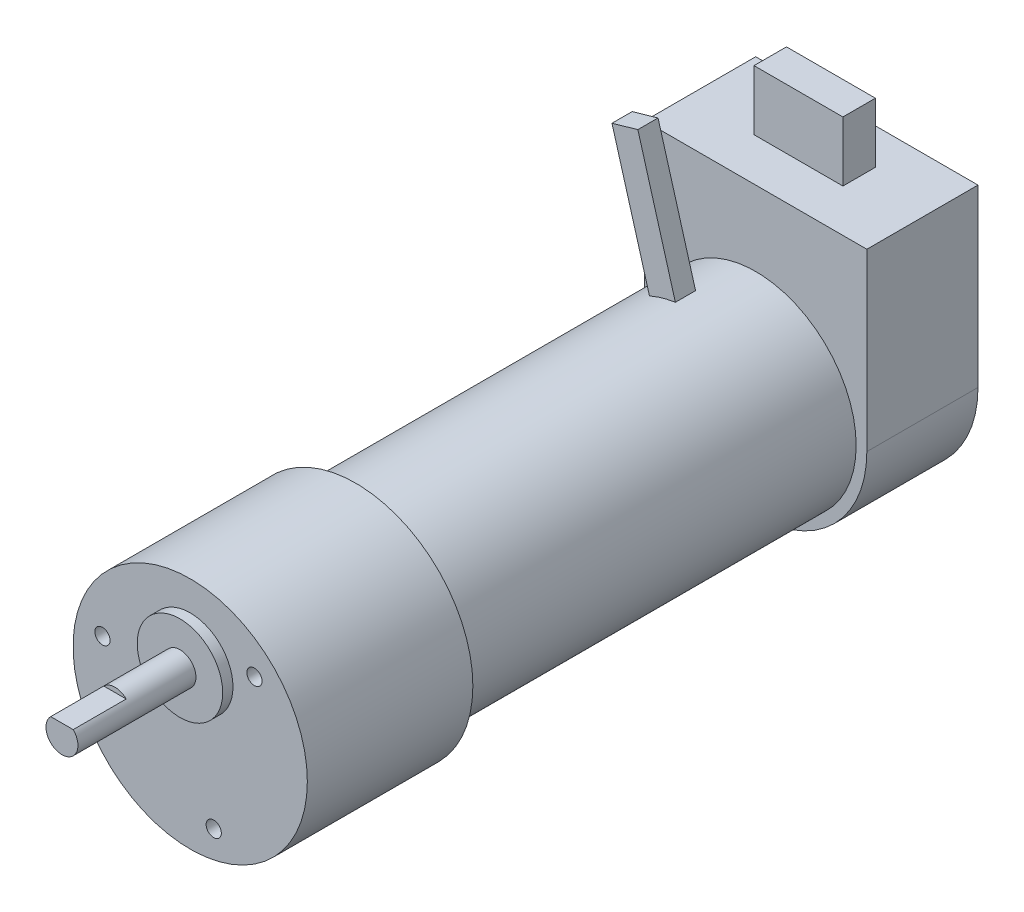
ISO-10303-21;
HEADER;
FILE_DESCRIPTION(('STEP AP214'),'2;1');
FILE_NAME('part.step','',(''),(''),'','','');
FILE_SCHEMA(('AUTOMOTIVE_DESIGN { 1 0 10303 214 1 1 1 1 }'));
ENDSEC;
DATA;
#1=APPLICATION_CONTEXT('core data for automotive mechanical design processes');
#2=APPLICATION_PROTOCOL_DEFINITION('international standard','automotive_design',2000,#1);
#3=PRODUCT_CONTEXT('',#1,'mechanical');
#4=PRODUCT('Part','Part','',(#3));
#5=PRODUCT_RELATED_PRODUCT_CATEGORY('part','',(#4));
#6=PRODUCT_DEFINITION_FORMATION('','',#4);
#7=PRODUCT_DEFINITION_CONTEXT('part definition',#1,'design');
#8=PRODUCT_DEFINITION('design','',#6,#7);
#9=PRODUCT_DEFINITION_SHAPE('','',#8);
#10=(LENGTH_UNIT() NAMED_UNIT(*) SI_UNIT(.MILLI.,.METRE.));
#11=(NAMED_UNIT(*) PLANE_ANGLE_UNIT() SI_UNIT($,.RADIAN.));
#12=(NAMED_UNIT(*) SI_UNIT($,.STERADIAN.) SOLID_ANGLE_UNIT());
#13=UNCERTAINTY_MEASURE_WITH_UNIT(LENGTH_MEASURE(1.E-05),#10,'distance_accuracy_value','');
#14=(GEOMETRIC_REPRESENTATION_CONTEXT(3) GLOBAL_UNCERTAINTY_ASSIGNED_CONTEXT((#13)) GLOBAL_UNIT_ASSIGNED_CONTEXT((#10,
#11,#12)) REPRESENTATION_CONTEXT('',''));
#15=CARTESIAN_POINT('',(0.,0.,0.));
#16=DIRECTION('',(0.,0.,1.));
#17=DIRECTION('',(1.,0.,0.));
#18=AXIS2_PLACEMENT_3D('',#15,#16,#17);
#19=CARTESIAN_POINT('',(0.,0.,0.));
#20=DIRECTION('',(0.,0.,-1.));
#21=DIRECTION('',(-1.,0.,0.));
#22=AXIS2_PLACEMENT_3D('',#19,#20,#21);
#23=PLANE('',#22);
#24=CARTESIAN_POINT('',(9.54152212863612,9.54152212863582,0.));
#25=DIRECTION('',(0.,0.,1.));
#26=DIRECTION('',(1.,0.,0.));
#27=AXIS2_PLACEMENT_3D('',#24,#25,#26);
#28=CIRCLE('',#27,1.1303);
#29=CARTESIAN_POINT('',(10.6718221286361,9.54152212863582,0.));
#30=VERTEX_POINT('',#29);
#31=EDGE_CURVE('E207',#30,#30,#28,.T.);
#32=ORIENTED_EDGE('',*,*,#31,.F.);
#33=EDGE_LOOP('',(#32));
#34=FACE_BOUND('',#33,.T.);
#35=CARTESIAN_POINT('',(-13.0339616184881,3.49243948985228,0.));
#36=DIRECTION('',(0.,0.,1.));
#37=DIRECTION('',(1.,0.,0.));
#38=AXIS2_PLACEMENT_3D('',#35,#36,#37);
#39=CIRCLE('',#38,1.1303);
#40=CARTESIAN_POINT('',(-11.9036616184881,3.49243948985228,0.));
#41=VERTEX_POINT('',#40);
#42=EDGE_CURVE('E216',#41,#41,#39,.T.);
#43=ORIENTED_EDGE('',*,*,#42,.F.);
#44=EDGE_LOOP('',(#43));
#45=FACE_BOUND('',#44,.T.);
#46=CARTESIAN_POINT('',(3.49243948985205,-13.0339616184881,0.));
#47=DIRECTION('',(0.,0.,1.));
#48=DIRECTION('',(1.,0.,0.));
#49=AXIS2_PLACEMENT_3D('',#46,#47,#48);
#50=CIRCLE('',#49,1.1303);
#51=CARTESIAN_POINT('',(4.62273948985205,-13.0339616184881,0.));
#52=VERTEX_POINT('',#51);
#53=EDGE_CURVE('E224',#52,#52,#50,.T.);
#54=ORIENTED_EDGE('',*,*,#53,.F.);
#55=EDGE_LOOP('',(#54));
#56=FACE_BOUND('',#55,.T.);
#57=CARTESIAN_POINT('',(0.,0.,0.));
#58=DIRECTION('',(0.,0.,1.));
#59=DIRECTION('',(1.,0.,0.));
#60=AXIS2_PLACEMENT_3D('',#57,#58,#59);
#61=CIRCLE('',#60,17.399);
#62=CARTESIAN_POINT('',(17.399,0.,0.));
#63=VERTEX_POINT('',#62);
#64=EDGE_CURVE('E340',#63,#63,#61,.T.);
#65=ORIENTED_EDGE('',*,*,#64,.T.);
#66=EDGE_LOOP('',(#65));
#67=FACE_BOUND('',#66,.T.);
#68=CARTESIAN_POINT('',(0.,6.6548,0.));
#69=DIRECTION('',(0.,0.,-1.));
#70=DIRECTION('',(-1.,0.,0.));
#71=AXIS2_PLACEMENT_3D('',#68,#69,#70);
#72=CIRCLE('',#71,6.35);
#73=CARTESIAN_POINT('',(-6.35,6.6548,0.));
#74=VERTEX_POINT('',#73);
#75=EDGE_CURVE('E344',#74,#74,#72,.F.);
#76=ORIENTED_EDGE('',*,*,#75,.F.);
#77=EDGE_LOOP('',(#76));
#78=FACE_BOUND('',#77,.T.);
#79=ADVANCED_FACE('F47',(#34,#45,#56,#67,#78),#23,.F.);
#80=CARTESIAN_POINT('',(16.51,26.035,-100.5078));
#81=DIRECTION('',(0.,-1.,0.));
#82=DIRECTION('',(0.,0.,-1.));
#83=AXIS2_PLACEMENT_3D('',#80,#81,#82);
#84=PLANE('',#83);
#85=DIRECTION('',(1.,0.,0.));
#86=VECTOR('',#85,1.);
#87=CARTESIAN_POINT('',(16.51,26.035,-83.9978));
#88=LINE('',#87,#86);
#89=CARTESIAN_POINT('',(-16.51,26.035,-83.9978));
#90=VERTEX_POINT('',#89);
#91=CARTESIAN_POINT('',(16.51,26.035,-83.9978));
#92=VERTEX_POINT('',#91);
#93=EDGE_CURVE('E311',#90,#92,#88,.T.);
#94=ORIENTED_EDGE('',*,*,#93,.T.);
#95=DIRECTION('',(0.,0.,1.));
#96=VECTOR('',#95,1.);
#97=CARTESIAN_POINT('',(16.51,26.035,-100.5078));
#98=LINE('',#97,#96);
#99=CARTESIAN_POINT('',(16.51,26.035,-100.5078));
#100=VERTEX_POINT('',#99);
#101=EDGE_CURVE('E317',#100,#92,#98,.T.);
#102=ORIENTED_EDGE('',*,*,#101,.F.);
#103=DIRECTION('',(1.,0.,0.));
#104=VECTOR('',#103,1.);
#105=CARTESIAN_POINT('',(16.51,26.035,-100.5078));
#106=LINE('',#105,#104);
#107=CARTESIAN_POINT('',(-16.51,26.035,-100.5078));
#108=VERTEX_POINT('',#107);
#109=EDGE_CURVE('E299',#108,#100,#106,.T.);
#110=ORIENTED_EDGE('',*,*,#109,.F.);
#111=DIRECTION('',(0.,0.,1.));
#112=VECTOR('',#111,1.);
#113=CARTESIAN_POINT('',(-16.51,26.035,-100.5078));
#114=LINE('',#113,#112);
#115=EDGE_CURVE('E320',#108,#90,#114,.T.);
#116=ORIENTED_EDGE('',*,*,#115,.T.);
#117=EDGE_LOOP('',(#94,#102,#110,#116));
#118=FACE_BOUND('',#117,.T.);
#119=DIRECTION('',(0.,0.,-1.));
#120=VECTOR('',#119,1.);
#121=CARTESIAN_POINT('',(6.604,26.035,-90.3478));
#122=LINE('',#121,#120);
#123=CARTESIAN_POINT('',(6.604,26.035,-90.3478));
#124=VERTEX_POINT('',#123);
#125=CARTESIAN_POINT('',(6.604,26.035,-95.1738));
#126=VERTEX_POINT('',#125);
#127=EDGE_CURVE('E264',#124,#126,#122,.T.);
#128=ORIENTED_EDGE('',*,*,#127,.F.);
#129=DIRECTION('',(-1.,0.,0.));
#130=VECTOR('',#129,1.);
#131=CARTESIAN_POINT('',(6.604,26.035,-90.3478));
#132=LINE('',#131,#130);
#133=CARTESIAN_POINT('',(-6.604,26.035,-90.3478));
#134=VERTEX_POINT('',#133);
#135=EDGE_CURVE('E288',#124,#134,#132,.T.);
#136=ORIENTED_EDGE('',*,*,#135,.T.);
#137=DIRECTION('',(0.,0.,-1.));
#138=VECTOR('',#137,1.);
#139=CARTESIAN_POINT('',(-6.604,26.035,-90.3478));
#140=LINE('',#139,#138);
#141=CARTESIAN_POINT('',(-6.604,26.035,-95.1738));
#142=VERTEX_POINT('',#141);
#143=EDGE_CURVE('E274',#134,#142,#140,.T.);
#144=ORIENTED_EDGE('',*,*,#143,.T.);
#145=DIRECTION('',(-1.,0.,0.));
#146=VECTOR('',#145,1.);
#147=CARTESIAN_POINT('',(6.604,26.035,-95.1738));
#148=LINE('',#147,#146);
#149=EDGE_CURVE('E285',#126,#142,#148,.T.);
#150=ORIENTED_EDGE('',*,*,#149,.F.);
#151=EDGE_LOOP('',(#128,#136,#144,#150));
#152=FACE_BOUND('',#151,.T.);
#153=ADVANCED_FACE('F375',(#118,#152),#84,.F.);
#154=CARTESIAN_POINT('',(0.,0.,55.));
#155=DIRECTION('',(0.,0.,1.));
#156=DIRECTION('',(1.,0.,0.));
#157=AXIS2_PLACEMENT_3D('',#154,#155,#156);
#158=CYLINDRICAL_SURFACE('',#157,17.399);
#159=ORIENTED_EDGE('',*,*,#64,.F.);
#160=EDGE_LOOP('',(#159));
#161=FACE_BOUND('',#160,.T.);
#162=CARTESIAN_POINT('',(0.,0.,-24.5872));
#163=DIRECTION('',(0.,0.,1.));
#164=DIRECTION('',(1.,0.,0.));
#165=AXIS2_PLACEMENT_3D('',#162,#163,#164);
#166=CIRCLE('',#165,17.399);
#167=CARTESIAN_POINT('',(17.399,0.,-24.5872));
#168=VERTEX_POINT('',#167);
#169=EDGE_CURVE('E336',#168,#168,#166,.T.);
#170=ORIENTED_EDGE('',*,*,#169,.T.);
#171=EDGE_LOOP('',(#170));
#172=FACE_BOUND('',#171,.T.);
#173=ADVANCED_FACE('F381',(#161,#172),#158,.T.);
#174=CARTESIAN_POINT('',(0.,17.399,-24.5872));
#175=DIRECTION('',(0.,0.,1.));
#176=DIRECTION('',(1.,0.,0.));
#177=AXIS2_PLACEMENT_3D('',#174,#175,#176);
#178=PLANE('',#177);
#179=ORIENTED_EDGE('',*,*,#169,.F.);
#180=EDGE_LOOP('',(#179));
#181=FACE_BOUND('',#180,.T.);
#182=CARTESIAN_POINT('',(0.,0.,-24.5872));
#183=DIRECTION('',(0.,0.,1.));
#184=DIRECTION('',(1.,0.,0.));
#185=AXIS2_PLACEMENT_3D('',#182,#183,#184);
#186=CIRCLE('',#185,14.9225);
#187=CARTESIAN_POINT('',(14.9225,0.,-24.5872));
#188=VERTEX_POINT('',#187);
#189=EDGE_CURVE('E332',#188,#188,#186,.T.);
#190=ORIENTED_EDGE('',*,*,#189,.T.);
#191=EDGE_LOOP('',(#190));
#192=FACE_BOUND('',#191,.T.);
#193=ADVANCED_FACE('F449',(#181,#192),#178,.F.);
#194=CARTESIAN_POINT('',(0.,0.,55.));
#195=DIRECTION('',(0.,0.,1.));
#196=DIRECTION('',(1.,0.,0.));
#197=AXIS2_PLACEMENT_3D('',#194,#195,#196);
#198=CYLINDRICAL_SURFACE('',#197,14.9225);
#199=DIRECTION('',(0.,0.,1.));
#200=VECTOR('',#199,1.);
#201=CARTESIAN_POINT('',(-2.15356512740972,14.7662846881673,55.));
#202=LINE('',#201,#200);
#203=CARTESIAN_POINT('',(-2.15356512740972,14.7662846881673,-77.2178));
#204=VERTEX_POINT('',#203);
#205=CARTESIAN_POINT('',(-2.15356512740972,14.7662846881673,-74.2178));
#206=VERTEX_POINT('',#205);
#207=EDGE_CURVE('E55',#204,#206,#202,.T.);
#208=ORIENTED_EDGE('',*,*,#207,.T.);
#209=CARTESIAN_POINT('',(0.,0.,-74.2178));
#210=DIRECTION('',(0.,0.,1.));
#211=DIRECTION('',(1.,0.,0.));
#212=AXIS2_PLACEMENT_3D('',#209,#210,#211);
#213=CIRCLE('',#212,14.9225);
#214=CARTESIAN_POINT('',(-5.998611911163,13.6637352648993,-74.2178));
#215=VERTEX_POINT('',#214);
#216=EDGE_CURVE('E11',#206,#215,#213,.T.);
#217=ORIENTED_EDGE('',*,*,#216,.T.);
#218=DIRECTION('',(0.,0.,1.));
#219=VECTOR('',#218,1.);
#220=CARTESIAN_POINT('',(-5.998611911163,13.6637352648993,55.));
#221=LINE('',#220,#219);
#222=CARTESIAN_POINT('',(-5.998611911163,13.6637352648993,-77.2178));
#223=VERTEX_POINT('',#222);
#224=EDGE_CURVE('E174',#215,#223,#221,.F.);
#225=ORIENTED_EDGE('',*,*,#224,.T.);
#226=CARTESIAN_POINT('',(0.,0.,-77.2178));
#227=DIRECTION('',(0.,0.,1.));
#228=DIRECTION('',(1.,0.,0.));
#229=AXIS2_PLACEMENT_3D('',#226,#227,#228);
#230=CIRCLE('',#229,14.9225);
#231=EDGE_CURVE('E348',#204,#223,#230,.T.);
#232=ORIENTED_EDGE('',*,*,#231,.F.);
#233=EDGE_LOOP('',(#208,#217,#225,#232));
#234=FACE_BOUND('',#233,.T.);
#235=ORIENTED_EDGE('',*,*,#189,.F.);
#236=EDGE_LOOP('',(#235));
#237=FACE_BOUND('',#236,.T.);
#238=CARTESIAN_POINT('',(0.,0.,-83.9978));
#239=DIRECTION('',(0.,0.,-1.));
#240=DIRECTION('',(-1.,0.,0.));
#241=AXIS2_PLACEMENT_3D('',#238,#239,#240);
#242=CIRCLE('',#241,14.9225);
#243=CARTESIAN_POINT('',(-14.9225,0.,-83.9978));
#244=VERTEX_POINT('',#243);
#245=EDGE_CURVE('E328',#244,#244,#242,.T.);
#246=ORIENTED_EDGE('',*,*,#245,.F.);
#247=EDGE_LOOP('',(#246));
#248=FACE_BOUND('',#247,.T.);
#249=ADVANCED_FACE('F354',(#234,#237,#248),#198,.T.);
#250=CARTESIAN_POINT('',(0.,0.,-83.9978));
#251=DIRECTION('',(0.,0.,-1.));
#252=DIRECTION('',(-1.,0.,0.));
#253=AXIS2_PLACEMENT_3D('',#250,#251,#252);
#254=PLANE('',#253);
#255=CARTESIAN_POINT('',(0.,0.,-83.9978));
#256=DIRECTION('',(0.,0.,-1.));
#257=DIRECTION('',(-1.,0.,0.));
#258=AXIS2_PLACEMENT_3D('',#255,#256,#257);
#259=CIRCLE('',#258,16.51);
#260=CARTESIAN_POINT('',(16.51,0.,-83.9978));
#261=VERTEX_POINT('',#260);
#262=CARTESIAN_POINT('',(-16.51,0.,-83.9978));
#263=VERTEX_POINT('',#262);
#264=EDGE_CURVE('E291',#261,#263,#259,.T.);
#265=ORIENTED_EDGE('',*,*,#264,.F.);
#266=DIRECTION('',(0.,-1.,0.));
#267=VECTOR('',#266,1.);
#268=CARTESIAN_POINT('',(16.51,0.,-83.9978));
#269=LINE('',#268,#267);
#270=EDGE_CURVE('E297',#92,#261,#269,.T.);
#271=ORIENTED_EDGE('',*,*,#270,.F.);
#272=ORIENTED_EDGE('',*,*,#93,.F.);
#273=DIRECTION('',(0.,1.,0.));
#274=VECTOR('',#273,1.);
#275=CARTESIAN_POINT('',(-16.51,26.035,-83.9978));
#276=LINE('',#275,#274);
#277=EDGE_CURVE('E308',#263,#90,#276,.T.);
#278=ORIENTED_EDGE('',*,*,#277,.F.);
#279=EDGE_LOOP('',(#265,#271,#272,#278));
#280=FACE_BOUND('',#279,.T.);
#281=ORIENTED_EDGE('',*,*,#245,.T.);
#282=EDGE_LOOP('',(#281));
#283=FACE_BOUND('',#282,.T.);
#284=ADVANCED_FACE('F433',(#280,#283),#254,.F.);
#285=CARTESIAN_POINT('',(0.,0.,-100.5078));
#286=DIRECTION('',(0.,0.,1.));
#287=DIRECTION('',(1.,0.,0.));
#288=AXIS2_PLACEMENT_3D('',#285,#286,#287);
#289=CYLINDRICAL_SURFACE('',#288,16.51);
#290=ORIENTED_EDGE('',*,*,#264,.T.);
#291=DIRECTION('',(0.,0.,1.));
#292=VECTOR('',#291,1.);
#293=CARTESIAN_POINT('',(-16.51,0.,-100.5078));
#294=LINE('',#293,#292);
#295=CARTESIAN_POINT('',(-16.51,0.,-100.5078));
#296=VERTEX_POINT('',#295);
#297=EDGE_CURVE('E324',#296,#263,#294,.T.);
#298=ORIENTED_EDGE('',*,*,#297,.F.);
#299=CARTESIAN_POINT('',(0.,0.,-100.5078));
#300=DIRECTION('',(0.,0.,-1.));
#301=DIRECTION('',(-1.,0.,0.));
#302=AXIS2_PLACEMENT_3D('',#299,#300,#301);
#303=CIRCLE('',#302,16.51);
#304=CARTESIAN_POINT('',(16.51,0.,-100.5078));
#305=VERTEX_POINT('',#304);
#306=EDGE_CURVE('E292',#305,#296,#303,.T.);
#307=ORIENTED_EDGE('',*,*,#306,.F.);
#308=DIRECTION('',(0.,0.,1.));
#309=VECTOR('',#308,1.);
#310=CARTESIAN_POINT('',(16.51,0.,-100.5078));
#311=LINE('',#310,#309);
#312=EDGE_CURVE('E304',#305,#261,#311,.T.);
#313=ORIENTED_EDGE('',*,*,#312,.T.);
#314=EDGE_LOOP('',(#290,#298,#307,#313));
#315=FACE_BOUND('',#314,.T.);
#316=ADVANCED_FACE('F436',(#315),#289,.T.);
#317=CARTESIAN_POINT('',(-16.51,26.035,-100.5078));
#318=DIRECTION('',(1.,0.,0.));
#319=DIRECTION('',(0.,0.,-1.));
#320=AXIS2_PLACEMENT_3D('',#317,#318,#319);
#321=PLANE('',#320);
#322=ORIENTED_EDGE('',*,*,#277,.T.);
#323=ORIENTED_EDGE('',*,*,#115,.F.);
#324=DIRECTION('',(0.,1.,0.));
#325=VECTOR('',#324,1.);
#326=CARTESIAN_POINT('',(-16.51,26.035,-100.5078));
#327=LINE('',#326,#325);
#328=EDGE_CURVE('E296',#296,#108,#327,.T.);
#329=ORIENTED_EDGE('',*,*,#328,.F.);
#330=ORIENTED_EDGE('',*,*,#297,.T.);
#331=EDGE_LOOP('',(#322,#323,#329,#330));
#332=FACE_BOUND('',#331,.T.);
#333=ADVANCED_FACE('F439',(#332),#321,.F.);
#334=CARTESIAN_POINT('',(16.51,0.,-100.5078));
#335=DIRECTION('',(-1.,0.,0.));
#336=DIRECTION('',(0.,0.,1.));
#337=AXIS2_PLACEMENT_3D('',#334,#335,#336);
#338=PLANE('',#337);
#339=ORIENTED_EDGE('',*,*,#270,.T.);
#340=ORIENTED_EDGE('',*,*,#312,.F.);
#341=DIRECTION('',(0.,-1.,0.));
#342=VECTOR('',#341,1.);
#343=CARTESIAN_POINT('',(16.51,0.,-100.5078));
#344=LINE('',#343,#342);
#345=EDGE_CURVE('E302',#100,#305,#344,.T.);
#346=ORIENTED_EDGE('',*,*,#345,.F.);
#347=ORIENTED_EDGE('',*,*,#101,.T.);
#348=EDGE_LOOP('',(#339,#340,#346,#347));
#349=FACE_BOUND('',#348,.T.);
#350=ADVANCED_FACE('F431',(#349),#338,.F.);
#351=CARTESIAN_POINT('',(0.,0.,-100.5078));
#352=DIRECTION('',(0.,0.,-1.));
#353=DIRECTION('',(-1.,0.,0.));
#354=AXIS2_PLACEMENT_3D('',#351,#352,#353);
#355=PLANE('',#354);
#356=ORIENTED_EDGE('',*,*,#306,.T.);
#357=ORIENTED_EDGE('',*,*,#328,.T.);
#358=ORIENTED_EDGE('',*,*,#109,.T.);
#359=ORIENTED_EDGE('',*,*,#345,.T.);
#360=EDGE_LOOP('',(#356,#357,#358,#359));
#361=FACE_BOUND('',#360,.T.);
#362=ADVANCED_FACE('F427',(#361),#355,.T.);
#363=CARTESIAN_POINT('',(6.604,26.035,-90.3478));
#364=DIRECTION('',(0.,0.,-1.));
#365=DIRECTION('',(-1.,0.,0.));
#366=AXIS2_PLACEMENT_3D('',#363,#364,#365);
#367=PLANE('',#366);
#368=DIRECTION('',(0.,-1.,0.));
#369=VECTOR('',#368,1.);
#370=CARTESIAN_POINT('',(-6.604,26.035,-90.3478));
#371=LINE('',#370,#369);
#372=CARTESIAN_POINT('',(-6.604,34.925,-90.3478));
#373=VERTEX_POINT('',#372);
#374=EDGE_CURVE('E261',#373,#134,#371,.T.);
#375=ORIENTED_EDGE('',*,*,#374,.T.);
#376=ORIENTED_EDGE('',*,*,#135,.F.);
#377=DIRECTION('',(0.,-1.,0.));
#378=VECTOR('',#377,1.);
#379=CARTESIAN_POINT('',(6.604,26.035,-90.3478));
#380=LINE('',#379,#378);
#381=CARTESIAN_POINT('',(6.604,34.925,-90.3478));
#382=VERTEX_POINT('',#381);
#383=EDGE_CURVE('E262',#382,#124,#380,.T.);
#384=ORIENTED_EDGE('',*,*,#383,.F.);
#385=DIRECTION('',(-1.,0.,0.));
#386=VECTOR('',#385,1.);
#387=CARTESIAN_POINT('',(6.604,34.925,-90.3478));
#388=LINE('',#387,#386);
#389=EDGE_CURVE('E271',#382,#373,#388,.T.);
#390=ORIENTED_EDGE('',*,*,#389,.T.);
#391=EDGE_LOOP('',(#375,#376,#384,#390));
#392=FACE_BOUND('',#391,.T.);
#393=ADVANCED_FACE('F423',(#392),#367,.F.);
#394=CARTESIAN_POINT('',(6.604,26.035,-95.1738));
#395=DIRECTION('',(0.,0.,1.));
#396=DIRECTION('',(1.,0.,0.));
#397=AXIS2_PLACEMENT_3D('',#394,#395,#396);
#398=PLANE('',#397);
#399=DIRECTION('',(0.,1.,0.));
#400=VECTOR('',#399,1.);
#401=CARTESIAN_POINT('',(-6.604,26.035,-95.1738));
#402=LINE('',#401,#400);
#403=CARTESIAN_POINT('',(-6.604,34.925,-95.1738));
#404=VERTEX_POINT('',#403);
#405=EDGE_CURVE('E277',#142,#404,#402,.T.);
#406=ORIENTED_EDGE('',*,*,#405,.T.);
#407=DIRECTION('',(-1.,0.,0.));
#408=VECTOR('',#407,1.);
#409=CARTESIAN_POINT('',(6.604,34.925,-95.1738));
#410=LINE('',#409,#408);
#411=CARTESIAN_POINT('',(6.604,34.925,-95.1738));
#412=VERTEX_POINT('',#411);
#413=EDGE_CURVE('E282',#412,#404,#410,.T.);
#414=ORIENTED_EDGE('',*,*,#413,.F.);
#415=DIRECTION('',(0.,1.,0.));
#416=VECTOR('',#415,1.);
#417=CARTESIAN_POINT('',(6.604,26.035,-95.1738));
#418=LINE('',#417,#416);
#419=EDGE_CURVE('E267',#126,#412,#418,.T.);
#420=ORIENTED_EDGE('',*,*,#419,.F.);
#421=ORIENTED_EDGE('',*,*,#149,.T.);
#422=EDGE_LOOP('',(#406,#414,#420,#421));
#423=FACE_BOUND('',#422,.T.);
#424=ADVANCED_FACE('F419',(#423),#398,.F.);
#425=CARTESIAN_POINT('',(6.604,34.925,-90.3478));
#426=DIRECTION('',(0.,-1.,0.));
#427=DIRECTION('',(0.,0.,-1.));
#428=AXIS2_PLACEMENT_3D('',#425,#426,#427);
#429=PLANE('',#428);
#430=DIRECTION('',(0.,0.,1.));
#431=VECTOR('',#430,1.);
#432=CARTESIAN_POINT('',(-6.604,34.925,-90.3478));
#433=LINE('',#432,#431);
#434=EDGE_CURVE('E265',#404,#373,#433,.T.);
#435=ORIENTED_EDGE('',*,*,#434,.T.);
#436=ORIENTED_EDGE('',*,*,#389,.F.);
#437=DIRECTION('',(0.,0.,1.));
#438=VECTOR('',#437,1.);
#439=CARTESIAN_POINT('',(6.604,34.925,-90.3478));
#440=LINE('',#439,#438);
#441=EDGE_CURVE('E269',#412,#382,#440,.T.);
#442=ORIENTED_EDGE('',*,*,#441,.F.);
#443=ORIENTED_EDGE('',*,*,#413,.T.);
#444=EDGE_LOOP('',(#435,#436,#442,#443));
#445=FACE_BOUND('',#444,.T.);
#446=ADVANCED_FACE('F414',(#445),#429,.F.);
#447=CARTESIAN_POINT('',(6.604,34.925,-90.3478));
#448=DIRECTION('',(-1.,0.,0.));
#449=DIRECTION('',(0.,0.,1.));
#450=AXIS2_PLACEMENT_3D('',#447,#448,#449);
#451=PLANE('',#450);
#452=ORIENTED_EDGE('',*,*,#383,.T.);
#453=ORIENTED_EDGE('',*,*,#127,.T.);
#454=ORIENTED_EDGE('',*,*,#419,.T.);
#455=ORIENTED_EDGE('',*,*,#441,.T.);
#456=EDGE_LOOP('',(#452,#453,#454,#455));
#457=FACE_BOUND('',#456,.T.);
#458=ADVANCED_FACE('F407',(#457),#451,.F.);
#459=CARTESIAN_POINT('',(-6.604,34.925,-90.3478));
#460=DIRECTION('',(-1.,0.,0.));
#461=DIRECTION('',(0.,0.,1.));
#462=AXIS2_PLACEMENT_3D('',#459,#460,#461);
#463=PLANE('',#462);
#464=ORIENTED_EDGE('',*,*,#374,.F.);
#465=ORIENTED_EDGE('',*,*,#434,.F.);
#466=ORIENTED_EDGE('',*,*,#405,.F.);
#467=ORIENTED_EDGE('',*,*,#143,.F.);
#468=EDGE_LOOP('',(#464,#465,#466,#467));
#469=FACE_BOUND('',#468,.T.);
#470=ADVANCED_FACE('F397',(#469),#463,.T.);
#471=CARTESIAN_POINT('',(0.,6.6548,5.02539));
#472=DIRECTION('',(0.,0.,1.));
#473=DIRECTION('',(1.,0.,0.));
#474=AXIS2_PLACEMENT_3D('',#471,#472,#473);
#475=CYLINDRICAL_SURFACE('',#474,6.35);
#476=CARTESIAN_POINT('',(0.,6.6548,1.524));
#477=DIRECTION('',(0.,0.,1.));
#478=DIRECTION('',(1.,0.,0.));
#479=AXIS2_PLACEMENT_3D('',#476,#477,#478);
#480=CIRCLE('',#479,6.35);
#481=CARTESIAN_POINT('',(6.35,6.6548,1.524));
#482=VERTEX_POINT('',#481);
#483=EDGE_CURVE('E257',#482,#482,#480,.T.);
#484=ORIENTED_EDGE('',*,*,#483,.F.);
#485=EDGE_LOOP('',(#484));
#486=FACE_BOUND('',#485,.T.);
#487=ORIENTED_EDGE('',*,*,#75,.T.);
#488=EDGE_LOOP('',(#487));
#489=FACE_BOUND('',#488,.T.);
#490=ADVANCED_FACE('F394',(#486,#489),#475,.T.);
#491=CARTESIAN_POINT('',(0.,13.0048,1.524));
#492=DIRECTION('',(0.,0.,-1.));
#493=DIRECTION('',(-1.,0.,0.));
#494=AXIS2_PLACEMENT_3D('',#491,#492,#493);
#495=PLANE('',#494);
#496=CARTESIAN_POINT('',(0.,6.6548,1.524));
#497=DIRECTION('',(0.,0.,1.));
#498=DIRECTION('',(1.,0.,0.));
#499=AXIS2_PLACEMENT_3D('',#496,#497,#498);
#500=CIRCLE('',#499,2.3749);
#501=CARTESIAN_POINT('',(2.3749,6.6548,1.524));
#502=VERTEX_POINT('',#501);
#503=EDGE_CURVE('E253',#502,#502,#500,.T.);
#504=ORIENTED_EDGE('',*,*,#503,.F.);
#505=EDGE_LOOP('',(#504));
#506=FACE_BOUND('',#505,.T.);
#507=ORIENTED_EDGE('',*,*,#483,.T.);
#508=EDGE_LOOP('',(#507));
#509=FACE_BOUND('',#508,.T.);
#510=ADVANCED_FACE('F396',(#506,#509),#495,.F.);
#511=CARTESIAN_POINT('',(0.,6.6548,5.02539));
#512=DIRECTION('',(0.,0.,1.));
#513=DIRECTION('',(1.,0.,0.));
#514=AXIS2_PLACEMENT_3D('',#511,#512,#513);
#515=CYLINDRICAL_SURFACE('',#514,2.3749);
#516=CARTESIAN_POINT('',(0.,6.6548,11.176));
#517=DIRECTION('',(0.,0.,1.));
#518=DIRECTION('',(1.,0.,0.));
#519=AXIS2_PLACEMENT_3D('',#516,#517,#518);
#520=CIRCLE('',#519,2.3749);
#521=CARTESIAN_POINT('',(1.66945835527575,8.3439,11.176));
#522=VERTEX_POINT('',#521);
#523=CARTESIAN_POINT('',(-1.66945835527575,8.3439,11.176));
#524=VERTEX_POINT('',#523);
#525=EDGE_CURVE('E233',#522,#524,#520,.T.);
#526=ORIENTED_EDGE('',*,*,#525,.F.);
#527=DIRECTION('',(0.,0.,1.));
#528=VECTOR('',#527,1.);
#529=CARTESIAN_POINT('',(1.66945835527575,8.3439,11.176));
#530=LINE('',#529,#528);
#531=CARTESIAN_POINT('',(1.66945835527575,8.3439,19.05));
#532=VERTEX_POINT('',#531);
#533=EDGE_CURVE('E243',#522,#532,#530,.T.);
#534=ORIENTED_EDGE('',*,*,#533,.T.);
#535=CARTESIAN_POINT('',(0.,6.6548,19.05));
#536=DIRECTION('',(0.,0.,1.));
#537=DIRECTION('',(1.,0.,0.));
#538=AXIS2_PLACEMENT_3D('',#535,#536,#537);
#539=CIRCLE('',#538,2.3749);
#540=CARTESIAN_POINT('',(-1.66945835527575,8.3439,19.05));
#541=VERTEX_POINT('',#540);
#542=EDGE_CURVE('E247',#541,#532,#539,.T.);
#543=ORIENTED_EDGE('',*,*,#542,.F.);
#544=DIRECTION('',(0.,0.,1.));
#545=VECTOR('',#544,1.);
#546=CARTESIAN_POINT('',(-1.66945835527575,8.3439,11.176));
#547=LINE('',#546,#545);
#548=EDGE_CURVE('E240',#524,#541,#547,.T.);
#549=ORIENTED_EDGE('',*,*,#548,.F.);
#550=EDGE_LOOP('',(#526,#534,#543,#549));
#551=FACE_BOUND('',#550,.T.);
#552=ORIENTED_EDGE('',*,*,#503,.T.);
#553=EDGE_LOOP('',(#552));
#554=FACE_BOUND('',#553,.T.);
#555=ADVANCED_FACE('F403',(#551,#554),#515,.T.);
#556=CARTESIAN_POINT('',(0.,9.0297,19.05));
#557=DIRECTION('',(0.,0.,-1.));
#558=DIRECTION('',(-1.,0.,0.));
#559=AXIS2_PLACEMENT_3D('',#556,#557,#558);
#560=PLANE('',#559);
#561=ORIENTED_EDGE('',*,*,#542,.T.);
#562=DIRECTION('',(1.,0.,0.));
#563=VECTOR('',#562,1.);
#564=CARTESIAN_POINT('',(-1.66945835527575,8.3439,19.05));
#565=LINE('',#564,#563);
#566=EDGE_CURVE('E232',#541,#532,#565,.T.);
#567=ORIENTED_EDGE('',*,*,#566,.F.);
#568=EDGE_LOOP('',(#561,#567));
#569=FACE_BOUND('',#568,.T.);
#570=ADVANCED_FACE('F466',(#569),#560,.F.);
#571=CARTESIAN_POINT('',(-1.66945835527575,8.3439,11.176));
#572=DIRECTION('',(0.,-1.,0.));
#573=DIRECTION('',(0.,0.,-1.));
#574=AXIS2_PLACEMENT_3D('',#571,#572,#573);
#575=PLANE('',#574);
#576=ORIENTED_EDGE('',*,*,#566,.T.);
#577=ORIENTED_EDGE('',*,*,#533,.F.);
#578=DIRECTION('',(1.,0.,0.));
#579=VECTOR('',#578,1.);
#580=CARTESIAN_POINT('',(-1.66945835527575,8.3439,11.176));
#581=LINE('',#580,#579);
#582=EDGE_CURVE('E236',#524,#522,#581,.T.);
#583=ORIENTED_EDGE('',*,*,#582,.F.);
#584=ORIENTED_EDGE('',*,*,#548,.T.);
#585=EDGE_LOOP('',(#576,#577,#583,#584));
#586=FACE_BOUND('',#585,.T.);
#587=ADVANCED_FACE('F478',(#586),#575,.F.);
#588=CARTESIAN_POINT('',(0.,6.6548,11.176));
#589=DIRECTION('',(0.,0.,1.));
#590=DIRECTION('',(1.,0.,0.));
#591=AXIS2_PLACEMENT_3D('',#588,#589,#590);
#592=PLANE('',#591);
#593=ORIENTED_EDGE('',*,*,#525,.T.);
#594=ORIENTED_EDGE('',*,*,#582,.T.);
#595=EDGE_LOOP('',(#593,#594));
#596=FACE_BOUND('',#595,.T.);
#597=ADVANCED_FACE('F486',(#596),#592,.T.);
#598=CARTESIAN_POINT('',(3.49243948985205,-13.0339616184881,-6.73));
#599=DIRECTION('',(0.,0.,1.));
#600=DIRECTION('',(1.,0.,0.));
#601=AXIS2_PLACEMENT_3D('',#598,#599,#600);
#602=CONICAL_SURFACE('',#601,1.1303,1.02974425867665);
#603=CARTESIAN_POINT('',(3.49243948985205,-13.0339616184881,-7.40915275768685));
#604=VERTEX_POINT('',#603);
#605=VERTEX_LOOP('',#604);
#606=FACE_BOUND('',#605,.T.);
#607=CARTESIAN_POINT('',(3.49243948985205,-13.0339616184881,-6.73));
#608=DIRECTION('',(0.,0.,1.));
#609=DIRECTION('',(1.,0.,0.));
#610=AXIS2_PLACEMENT_3D('',#607,#608,#609);
#611=CIRCLE('',#610,1.1303);
#612=CARTESIAN_POINT('',(4.62273948985205,-13.0339616184881,-6.73));
#613=VERTEX_POINT('',#612);
#614=EDGE_CURVE('E228',#613,#613,#611,.T.);
#615=ORIENTED_EDGE('',*,*,#614,.T.);
#616=EDGE_LOOP('',(#615));
#617=FACE_BOUND('',#616,.T.);
#618=ADVANCED_FACE('F495',(#606,#617),#602,.F.);
#619=CARTESIAN_POINT('',(3.49243948985205,-13.0339616184881,0.));
#620=DIRECTION('',(0.,0.,1.));
#621=DIRECTION('',(1.,0.,0.));
#622=AXIS2_PLACEMENT_3D('',#619,#620,#621);
#623=CYLINDRICAL_SURFACE('',#622,1.1303);
#624=ORIENTED_EDGE('',*,*,#614,.F.);
#625=EDGE_LOOP('',(#624));
#626=FACE_BOUND('',#625,.T.);
#627=ORIENTED_EDGE('',*,*,#53,.T.);
#628=EDGE_LOOP('',(#627));
#629=FACE_BOUND('',#628,.T.);
#630=ADVANCED_FACE('F504',(#626,#629),#623,.F.);
#631=CARTESIAN_POINT('',(-13.0339616184881,3.49243948985228,-6.73));
#632=DIRECTION('',(0.,0.,1.));
#633=DIRECTION('',(1.,0.,0.));
#634=AXIS2_PLACEMENT_3D('',#631,#632,#633);
#635=CONICAL_SURFACE('',#634,1.1303,1.02974425867665);
#636=CARTESIAN_POINT('',(-13.0339616184881,3.49243948985228,-7.40915275768685));
#637=VERTEX_POINT('',#636);
#638=VERTEX_LOOP('',#637);
#639=FACE_BOUND('',#638,.T.);
#640=CARTESIAN_POINT('',(-13.0339616184881,3.49243948985228,-6.73));
#641=DIRECTION('',(0.,0.,1.));
#642=DIRECTION('',(1.,0.,0.));
#643=AXIS2_PLACEMENT_3D('',#640,#641,#642);
#644=CIRCLE('',#643,1.1303);
#645=CARTESIAN_POINT('',(-11.9036616184881,3.49243948985228,-6.73));
#646=VERTEX_POINT('',#645);
#647=EDGE_CURVE('E220',#646,#646,#644,.T.);
#648=ORIENTED_EDGE('',*,*,#647,.T.);
#649=EDGE_LOOP('',(#648));
#650=FACE_BOUND('',#649,.T.);
#651=ADVANCED_FACE('F513',(#639,#650),#635,.F.);
#652=CARTESIAN_POINT('',(-13.0339616184881,3.49243948985228,0.));
#653=DIRECTION('',(0.,0.,1.));
#654=DIRECTION('',(1.,0.,0.));
#655=AXIS2_PLACEMENT_3D('',#652,#653,#654);
#656=CYLINDRICAL_SURFACE('',#655,1.1303);
#657=ORIENTED_EDGE('',*,*,#647,.F.);
#658=EDGE_LOOP('',(#657));
#659=FACE_BOUND('',#658,.T.);
#660=ORIENTED_EDGE('',*,*,#42,.T.);
#661=EDGE_LOOP('',(#660));
#662=FACE_BOUND('',#661,.T.);
#663=ADVANCED_FACE('F522',(#659,#662),#656,.F.);
#664=CARTESIAN_POINT('',(9.54152212863612,9.54152212863582,-6.73));
#665=DIRECTION('',(0.,0.,1.));
#666=DIRECTION('',(1.,0.,0.));
#667=AXIS2_PLACEMENT_3D('',#664,#665,#666);
#668=CONICAL_SURFACE('',#667,1.1303,1.02974425867665);
#669=CARTESIAN_POINT('',(9.54152212863612,9.54152212863582,-7.40915275768685));
#670=VERTEX_POINT('',#669);
#671=VERTEX_LOOP('',#670);
#672=FACE_BOUND('',#671,.T.);
#673=CARTESIAN_POINT('',(9.54152212863612,9.54152212863582,-6.73));
#674=DIRECTION('',(0.,0.,1.));
#675=DIRECTION('',(1.,0.,0.));
#676=AXIS2_PLACEMENT_3D('',#673,#674,#675);
#677=CIRCLE('',#676,1.1303);
#678=CARTESIAN_POINT('',(10.6718221286361,9.54152212863582,-6.73));
#679=VERTEX_POINT('',#678);
#680=EDGE_CURVE('E212',#679,#679,#677,.T.);
#681=ORIENTED_EDGE('',*,*,#680,.T.);
#682=EDGE_LOOP('',(#681));
#683=FACE_BOUND('',#682,.T.);
#684=ADVANCED_FACE('F369',(#672,#683),#668,.F.);
#685=CARTESIAN_POINT('',(9.54152212863612,9.54152212863582,0.));
#686=DIRECTION('',(0.,0.,1.));
#687=DIRECTION('',(1.,0.,0.));
#688=AXIS2_PLACEMENT_3D('',#685,#686,#687);
#689=CYLINDRICAL_SURFACE('',#688,1.1303);
#690=ORIENTED_EDGE('',*,*,#680,.F.);
#691=EDGE_LOOP('',(#690));
#692=FACE_BOUND('',#691,.T.);
#693=ORIENTED_EDGE('',*,*,#31,.T.);
#694=EDGE_LOOP('',(#693));
#695=FACE_BOUND('',#694,.T.);
#696=ADVANCED_FACE('F362',(#692,#695),#689,.F.);
#697=CARTESIAN_POINT('',(1.92252339187664,0.551274711634001,-74.2178));
#698=DIRECTION('',(0.961261695938319,0.275637355817,0.));
#699=DIRECTION('',(-0.275637355817,0.961261695938319,0.));
#700=AXIS2_PLACEMENT_3D('',#697,#698,#699);
#701=PLANE('',#700);
#702=ORIENTED_EDGE('',*,*,#207,.F.);
#703=DIRECTION('',(0.275637355817,-0.961261695938319,0.));
#704=VECTOR('',#703,1.);
#705=CARTESIAN_POINT('',(1.92252339187664,0.551274711634001,-77.2178));
#706=LINE('',#705,#704);
#707=CARTESIAN_POINT('',(-7.72478406171835,34.1954340694752,-77.2178));
#708=VERTEX_POINT('',#707);
#709=EDGE_CURVE('E179',#708,#204,#706,.T.);
#710=ORIENTED_EDGE('',*,*,#709,.F.);
#711=DIRECTION('',(0.,0.,-1.));
#712=VECTOR('',#711,1.);
#713=CARTESIAN_POINT('',(-7.72478406171835,34.1954340694752,-74.2178));
#714=LINE('',#713,#712);
#715=CARTESIAN_POINT('',(-7.72478406171835,34.1954340694752,-74.2178));
#716=VERTEX_POINT('',#715);
#717=EDGE_CURVE('E187',#716,#708,#714,.T.);
#718=ORIENTED_EDGE('',*,*,#717,.F.);
#719=DIRECTION('',(0.275637355817,-0.961261695938319,0.));
#720=VECTOR('',#719,1.);
#721=CARTESIAN_POINT('',(1.92252339187664,0.551274711634001,-74.2178));
#722=LINE('',#721,#720);
#723=EDGE_CURVE('E188',#716,#206,#722,.T.);
#724=ORIENTED_EDGE('',*,*,#723,.T.);
#725=EDGE_LOOP('',(#702,#710,#718,#724));
#726=FACE_BOUND('',#725,.T.);
#727=ADVANCED_FACE('F360',(#726),#701,.T.);
#728=CARTESIAN_POINT('',(-11.5698308454716,33.0928846462072,-74.2178));
#729=DIRECTION('',(-0.961261695938319,-0.275637355817,0.));
#730=DIRECTION('',(0.275637355817,-0.961261695938319,0.));
#731=AXIS2_PLACEMENT_3D('',#728,#729,#730);
#732=PLANE('',#731);
#733=ORIENTED_EDGE('',*,*,#224,.F.);
#734=DIRECTION('',(-0.275637355817,0.961261695938319,0.));
#735=VECTOR('',#734,1.);
#736=CARTESIAN_POINT('',(-11.5698308454716,33.0928846462072,-74.2178));
#737=LINE('',#736,#735);
#738=CARTESIAN_POINT('',(-11.5698308454716,33.0928846462072,-74.2178));
#739=VERTEX_POINT('',#738);
#740=EDGE_CURVE('E168',#215,#739,#737,.T.);
#741=ORIENTED_EDGE('',*,*,#740,.T.);
#742=DIRECTION('',(0.,0.,-1.));
#743=VECTOR('',#742,1.);
#744=CARTESIAN_POINT('',(-11.5698308454716,33.0928846462072,-74.2178));
#745=LINE('',#744,#743);
#746=CARTESIAN_POINT('',(-11.5698308454716,33.0928846462072,-77.2178));
#747=VERTEX_POINT('',#746);
#748=EDGE_CURVE('E172',#739,#747,#745,.T.);
#749=ORIENTED_EDGE('',*,*,#748,.T.);
#750=DIRECTION('',(-0.275637355817,0.961261695938319,0.));
#751=VECTOR('',#750,1.);
#752=CARTESIAN_POINT('',(-11.5698308454716,33.0928846462072,-77.2178));
#753=LINE('',#752,#751);
#754=EDGE_CURVE('E199',#223,#747,#753,.T.);
#755=ORIENTED_EDGE('',*,*,#754,.F.);
#756=EDGE_LOOP('',(#733,#741,#749,#755));
#757=FACE_BOUND('',#756,.T.);
#758=ADVANCED_FACE('F170',(#757),#732,.T.);
#759=CARTESIAN_POINT('',(1.92252339187664,0.551274711634001,-74.2178));
#760=DIRECTION('',(0.,0.,1.));
#761=DIRECTION('',(1.,0.,0.));
#762=AXIS2_PLACEMENT_3D('',#759,#760,#761);
#763=PLANE('',#762);
#764=ORIENTED_EDGE('',*,*,#216,.F.);
#765=ORIENTED_EDGE('',*,*,#723,.F.);
#766=DIRECTION('',(0.961261695938319,0.275637355817,0.));
#767=VECTOR('',#766,1.);
#768=CARTESIAN_POINT('',(-7.72478406171835,34.1954340694752,-74.2178));
#769=LINE('',#768,#767);
#770=EDGE_CURVE('E178',#739,#716,#769,.T.);
#771=ORIENTED_EDGE('',*,*,#770,.F.);
#772=ORIENTED_EDGE('',*,*,#740,.F.);
#773=EDGE_LOOP('',(#764,#765,#771,#772));
#774=FACE_BOUND('',#773,.T.);
#775=ADVANCED_FACE('F191',(#774),#763,.T.);
#776=CARTESIAN_POINT('',(1.92252339187664,0.551274711634001,-77.2178));
#777=DIRECTION('',(0.,0.,1.));
#778=DIRECTION('',(1.,0.,0.));
#779=AXIS2_PLACEMENT_3D('',#776,#777,#778);
#780=PLANE('',#779);
#781=ORIENTED_EDGE('',*,*,#709,.T.);
#782=ORIENTED_EDGE('',*,*,#231,.T.);
#783=ORIENTED_EDGE('',*,*,#754,.T.);
#784=DIRECTION('',(0.961261695938319,0.275637355817,0.));
#785=VECTOR('',#784,1.);
#786=CARTESIAN_POINT('',(-7.72478406171835,34.1954340694752,-77.2178));
#787=LINE('',#786,#785);
#788=EDGE_CURVE('E185',#747,#708,#787,.T.);
#789=ORIENTED_EDGE('',*,*,#788,.T.);
#790=EDGE_LOOP('',(#781,#782,#783,#789));
#791=FACE_BOUND('',#790,.T.);
#792=ADVANCED_FACE('F357',(#791),#780,.F.);
#793=CARTESIAN_POINT('',(-7.72478406171835,34.1954340694752,-74.2178));
#794=DIRECTION('',(-0.275637355816999,0.961261695938319,0.));
#795=DIRECTION('',(-0.961261695938319,-0.275637355816999,0.));
#796=AXIS2_PLACEMENT_3D('',#793,#794,#795);
#797=PLANE('',#796);
#798=ORIENTED_EDGE('',*,*,#788,.F.);
#799=ORIENTED_EDGE('',*,*,#748,.F.);
#800=ORIENTED_EDGE('',*,*,#770,.T.);
#801=ORIENTED_EDGE('',*,*,#717,.T.);
#802=EDGE_LOOP('',(#798,#799,#800,#801));
#803=FACE_BOUND('',#802,.T.);
#804=ADVANCED_FACE('F183',(#803),#797,.T.);
#805=CLOSED_SHELL('',(#79,#153,#173,#193,#249,#284,#316,#333,#350,#362,#393,#424,#446,#458,#470,
#490,#510,#555,#570,#587,#597,#618,#630,#651,#663,#684,#696,#727,#758,#775,#792,#804));
#806=MANIFOLD_SOLID_BREP('B2',#805);
#807=ADVANCED_BREP_SHAPE_REPRESENTATION('',(#18,#806),#14);
#808=SHAPE_DEFINITION_REPRESENTATION(#9,#807);
ENDSEC;
END-ISO-10303-21;
